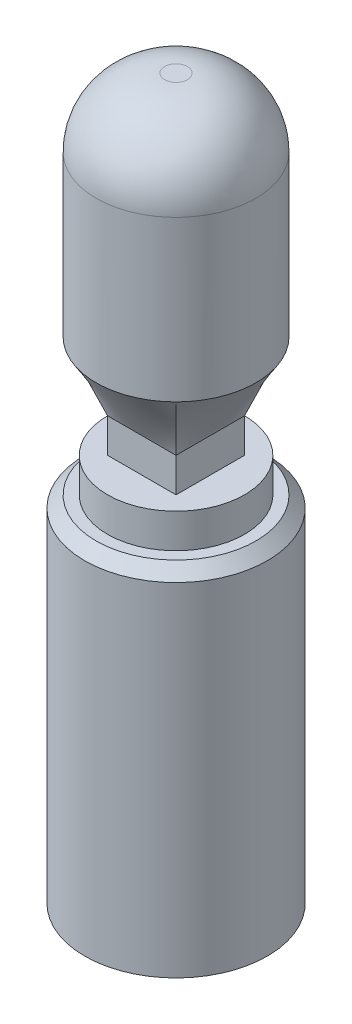
ISO-10303-21;
HEADER;
FILE_DESCRIPTION(('STEP AP214'),'2;1');
FILE_NAME('part.step','',(''),(''),'','','');
FILE_SCHEMA(('AUTOMOTIVE_DESIGN { 1 0 10303 214 1 1 1 1 }'));
ENDSEC;
DATA;
#1=APPLICATION_CONTEXT('core data for automotive mechanical design processes');
#2=APPLICATION_PROTOCOL_DEFINITION('international standard','automotive_design',2000,#1);
#3=PRODUCT_CONTEXT('',#1,'mechanical');
#4=PRODUCT('Part','Part','',(#3));
#5=PRODUCT_RELATED_PRODUCT_CATEGORY('part','',(#4));
#6=PRODUCT_DEFINITION_FORMATION('','',#4);
#7=PRODUCT_DEFINITION_CONTEXT('part definition',#1,'design');
#8=PRODUCT_DEFINITION('design','',#6,#7);
#9=PRODUCT_DEFINITION_SHAPE('','',#8);
#10=(LENGTH_UNIT() NAMED_UNIT(*) SI_UNIT(.MILLI.,.METRE.));
#11=(NAMED_UNIT(*) PLANE_ANGLE_UNIT() SI_UNIT($,.RADIAN.));
#12=(NAMED_UNIT(*) SI_UNIT($,.STERADIAN.) SOLID_ANGLE_UNIT());
#13=UNCERTAINTY_MEASURE_WITH_UNIT(LENGTH_MEASURE(1.E-05),#10,'distance_accuracy_value','');
#14=(GEOMETRIC_REPRESENTATION_CONTEXT(3) GLOBAL_UNCERTAINTY_ASSIGNED_CONTEXT((#13)) GLOBAL_UNIT_ASSIGNED_CONTEXT((#10,
#11,#12)) REPRESENTATION_CONTEXT('',''));
#15=CARTESIAN_POINT('',(0.,0.,0.));
#16=DIRECTION('',(0.,0.,1.));
#17=DIRECTION('',(1.,0.,0.));
#18=AXIS2_PLACEMENT_3D('',#15,#16,#17);
#19=CARTESIAN_POINT('',(0.,30.,0.));
#20=DIRECTION('',(0.,-1.,0.));
#21=DIRECTION('',(0.,0.,-1.));
#22=AXIS2_PLACEMENT_3D('',#19,#20,#21);
#23=CYLINDRICAL_SURFACE('',#22,8.);
#24=CARTESIAN_POINT('',(0.,30.,0.));
#25=DIRECTION('',(0.,1.,0.));
#26=DIRECTION('',(0.,0.,1.));
#27=AXIS2_PLACEMENT_3D('',#24,#25,#26);
#28=CIRCLE('',#27,8.);
#29=CARTESIAN_POINT('',(0.,30.,8.));
#30=VERTEX_POINT('',#29);
#31=EDGE_CURVE('E156',#30,#30,#28,.T.);
#32=ORIENTED_EDGE('',*,*,#31,.F.);
#33=EDGE_LOOP('',(#32));
#34=FACE_BOUND('',#33,.T.);
#35=CARTESIAN_POINT('',(0.,0.,0.));
#36=DIRECTION('',(0.,1.,0.));
#37=DIRECTION('',(0.,0.,1.));
#38=AXIS2_PLACEMENT_3D('',#35,#36,#37);
#39=CIRCLE('',#38,8.);
#40=CARTESIAN_POINT('',(0.,0.,8.));
#41=VERTEX_POINT('',#40);
#42=EDGE_CURVE('E159',#41,#41,#39,.T.);
#43=ORIENTED_EDGE('',*,*,#42,.T.);
#44=EDGE_LOOP('',(#43));
#45=FACE_BOUND('',#44,.T.);
#46=ADVANCED_FACE('F62',(#34,#45),#23,.T.);
#47=CARTESIAN_POINT('',(0.,0.,0.));
#48=DIRECTION('',(0.,1.,0.));
#49=DIRECTION('',(0.,0.,1.));
#50=AXIS2_PLACEMENT_3D('',#47,#48,#49);
#51=PLANE('',#50);
#52=CARTESIAN_POINT('',(0.,0.,0.));
#53=DIRECTION('',(0.,-1.,0.));
#54=DIRECTION('',(0.,0.,-1.));
#55=AXIS2_PLACEMENT_3D('',#52,#53,#54);
#56=CIRCLE('',#55,2.05);
#57=CARTESIAN_POINT('',(0.,0.,-2.05));
#58=VERTEX_POINT('',#57);
#59=EDGE_CURVE('E346',#58,#58,#56,.T.);
#60=ORIENTED_EDGE('',*,*,#59,.F.);
#61=EDGE_LOOP('',(#60));
#62=FACE_BOUND('',#61,.T.);
#63=ORIENTED_EDGE('',*,*,#42,.F.);
#64=EDGE_LOOP('',(#63));
#65=FACE_BOUND('',#64,.T.);
#66=ADVANCED_FACE('F217',(#62,#65),#51,.F.);
#67=CARTESIAN_POINT('',(0.,30.,0.));
#68=DIRECTION('',(0.,-1.,0.));
#69=DIRECTION('',(0.,0.,1.));
#70=AXIS2_PLACEMENT_3D('',#67,#68,#69);
#71=CONICAL_SURFACE('',#70,8.,0.78539816339745);
#72=CARTESIAN_POINT('',(0.,31.,0.));
#73=DIRECTION('',(0.,1.,0.));
#74=DIRECTION('',(0.,0.,1.));
#75=AXIS2_PLACEMENT_3D('',#72,#73,#74);
#76=CIRCLE('',#75,7.);
#77=CARTESIAN_POINT('',(0.,31.,7.));
#78=VERTEX_POINT('',#77);
#79=EDGE_CURVE('E152',#78,#78,#76,.T.);
#80=ORIENTED_EDGE('',*,*,#79,.F.);
#81=EDGE_LOOP('',(#80));
#82=FACE_BOUND('',#81,.T.);
#83=ORIENTED_EDGE('',*,*,#31,.T.);
#84=EDGE_LOOP('',(#83));
#85=FACE_BOUND('',#84,.T.);
#86=ADVANCED_FACE('F222',(#82,#85),#71,.T.);
#87=CARTESIAN_POINT('',(0.,31.,0.));
#88=DIRECTION('',(0.,1.,0.));
#89=DIRECTION('',(0.,0.,1.));
#90=AXIS2_PLACEMENT_3D('',#87,#88,#89);
#91=PLANE('',#90);
#92=CARTESIAN_POINT('',(0.,31.,0.));
#93=DIRECTION('',(0.,1.,0.));
#94=DIRECTION('',(0.,0.,1.));
#95=AXIS2_PLACEMENT_3D('',#92,#93,#94);
#96=CIRCLE('',#95,6.);
#97=CARTESIAN_POINT('',(0.,31.,6.));
#98=VERTEX_POINT('',#97);
#99=EDGE_CURVE('E153',#98,#98,#96,.T.);
#100=ORIENTED_EDGE('',*,*,#99,.F.);
#101=EDGE_LOOP('',(#100));
#102=FACE_BOUND('',#101,.T.);
#103=ORIENTED_EDGE('',*,*,#79,.T.);
#104=EDGE_LOOP('',(#103));
#105=FACE_BOUND('',#104,.T.);
#106=ADVANCED_FACE('F230',(#102,#105),#91,.T.);
#107=CARTESIAN_POINT('',(0.,34.,0.));
#108=DIRECTION('',(0.,-1.,0.));
#109=DIRECTION('',(0.,0.,-1.));
#110=AXIS2_PLACEMENT_3D('',#107,#108,#109);
#111=CYLINDRICAL_SURFACE('',#110,6.);
#112=CARTESIAN_POINT('',(0.,34.,0.));
#113=DIRECTION('',(0.,1.,0.));
#114=DIRECTION('',(0.,0.,1.));
#115=AXIS2_PLACEMENT_3D('',#112,#113,#114);
#116=CIRCLE('',#115,6.);
#117=CARTESIAN_POINT('',(0.,34.,6.));
#118=VERTEX_POINT('',#117);
#119=EDGE_CURVE('E131',#118,#118,#116,.T.);
#120=ORIENTED_EDGE('',*,*,#119,.F.);
#121=EDGE_LOOP('',(#120));
#122=FACE_BOUND('',#121,.T.);
#123=ORIENTED_EDGE('',*,*,#99,.T.);
#124=EDGE_LOOP('',(#123));
#125=FACE_BOUND('',#124,.T.);
#126=ADVANCED_FACE('F234',(#122,#125),#111,.T.);
#127=CARTESIAN_POINT('',(0.,34.,0.));
#128=DIRECTION('',(0.,1.,0.));
#129=DIRECTION('',(0.,0.,1.));
#130=AXIS2_PLACEMENT_3D('',#127,#128,#129);
#131=PLANE('',#130);
#132=DIRECTION('',(0.,0.,-1.));
#133=VECTOR('',#132,1.);
#134=CARTESIAN_POINT('',(3.,34.,3.));
#135=LINE('',#134,#133);
#136=CARTESIAN_POINT('',(3.,34.,3.));
#137=VERTEX_POINT('',#136);
#138=CARTESIAN_POINT('',(3.,34.,-3.));
#139=VERTEX_POINT('',#138);
#140=EDGE_CURVE('E79',#137,#139,#135,.T.);
#141=ORIENTED_EDGE('',*,*,#140,.F.);
#142=DIRECTION('',(1.,0.,0.));
#143=VECTOR('',#142,1.);
#144=CARTESIAN_POINT('',(-3.,34.,3.));
#145=LINE('',#144,#143);
#146=CARTESIAN_POINT('',(-3.,34.,3.));
#147=VERTEX_POINT('',#146);
#148=EDGE_CURVE('E148',#147,#137,#145,.T.);
#149=ORIENTED_EDGE('',*,*,#148,.F.);
#150=DIRECTION('',(0.,0.,1.));
#151=VECTOR('',#150,1.);
#152=CARTESIAN_POINT('',(-3.,34.,3.));
#153=LINE('',#152,#151);
#154=CARTESIAN_POINT('',(-3.,34.,-3.));
#155=VERTEX_POINT('',#154);
#156=EDGE_CURVE('E122',#155,#147,#153,.T.);
#157=ORIENTED_EDGE('',*,*,#156,.F.);
#158=DIRECTION('',(-1.,0.,0.));
#159=VECTOR('',#158,1.);
#160=CARTESIAN_POINT('',(-3.,34.,-3.));
#161=LINE('',#160,#159);
#162=EDGE_CURVE('E117',#139,#155,#161,.T.);
#163=ORIENTED_EDGE('',*,*,#162,.F.);
#164=EDGE_LOOP('',(#141,#149,#157,#163));
#165=FACE_BOUND('',#164,.T.);
#166=ORIENTED_EDGE('',*,*,#119,.T.);
#167=EDGE_LOOP('',(#166));
#168=FACE_BOUND('',#167,.T.);
#169=ADVANCED_FACE('F119',(#165,#168),#131,.T.);
#170=CARTESIAN_POINT('',(3.,37.,3.));
#171=DIRECTION('',(-1.,0.,0.));
#172=DIRECTION('',(0.,0.,1.));
#173=AXIS2_PLACEMENT_3D('',#170,#171,#172);
#174=PLANE('',#173);
#175=ORIENTED_EDGE('',*,*,#140,.T.);
#176=DIRECTION('',(0.,-1.,0.));
#177=VECTOR('',#176,1.);
#178=CARTESIAN_POINT('',(3.,37.,-3.));
#179=LINE('',#178,#177);
#180=CARTESIAN_POINT('',(3.,37.,-3.));
#181=VERTEX_POINT('',#180);
#182=EDGE_CURVE('E127',#181,#139,#179,.T.);
#183=ORIENTED_EDGE('',*,*,#182,.F.);
#184=DIRECTION('',(0.,0.,1.));
#185=VECTOR('',#184,1.);
#186=CARTESIAN_POINT('',(3.,37.,3.));
#187=LINE('',#186,#185);
#188=CARTESIAN_POINT('',(3.,37.,3.));
#189=VERTEX_POINT('',#188);
#190=EDGE_CURVE('E98',#189,#181,#187,.F.);
#191=ORIENTED_EDGE('',*,*,#190,.F.);
#192=DIRECTION('',(0.,-1.,0.));
#193=VECTOR('',#192,1.);
#194=CARTESIAN_POINT('',(3.,37.,3.));
#195=LINE('',#194,#193);
#196=EDGE_CURVE('E135',#189,#137,#195,.T.);
#197=ORIENTED_EDGE('',*,*,#196,.T.);
#198=EDGE_LOOP('',(#175,#183,#191,#197));
#199=FACE_BOUND('',#198,.T.);
#200=ADVANCED_FACE('F134',(#199),#174,.F.);
#201=CARTESIAN_POINT('',(-3.,37.,-3.));
#202=DIRECTION('',(0.,0.,1.));
#203=DIRECTION('',(1.,0.,0.));
#204=AXIS2_PLACEMENT_3D('',#201,#202,#203);
#205=PLANE('',#204);
#206=ORIENTED_EDGE('',*,*,#162,.T.);
#207=DIRECTION('',(0.,-1.,0.));
#208=VECTOR('',#207,1.);
#209=CARTESIAN_POINT('',(-3.,37.,-3.));
#210=LINE('',#209,#208);
#211=CARTESIAN_POINT('',(-3.,37.,-3.));
#212=VERTEX_POINT('',#211);
#213=EDGE_CURVE('E132',#212,#155,#210,.T.);
#214=ORIENTED_EDGE('',*,*,#213,.F.);
#215=DIRECTION('',(1.,0.,0.));
#216=VECTOR('',#215,1.);
#217=CARTESIAN_POINT('',(-3.,37.,-3.));
#218=LINE('',#217,#216);
#219=EDGE_CURVE('E130',#181,#212,#218,.F.);
#220=ORIENTED_EDGE('',*,*,#219,.F.);
#221=ORIENTED_EDGE('',*,*,#182,.T.);
#222=EDGE_LOOP('',(#206,#214,#220,#221));
#223=FACE_BOUND('',#222,.T.);
#224=ADVANCED_FACE('F128',(#223),#205,.F.);
#225=CARTESIAN_POINT('',(-3.,37.,3.));
#226=DIRECTION('',(1.,0.,0.));
#227=DIRECTION('',(0.,0.,-1.));
#228=AXIS2_PLACEMENT_3D('',#225,#226,#227);
#229=PLANE('',#228);
#230=ORIENTED_EDGE('',*,*,#156,.T.);
#231=DIRECTION('',(0.,-1.,0.));
#232=VECTOR('',#231,1.);
#233=CARTESIAN_POINT('',(-3.,37.,3.));
#234=LINE('',#233,#232);
#235=CARTESIAN_POINT('',(-3.,37.,3.));
#236=VERTEX_POINT('',#235);
#237=EDGE_CURVE('E165',#236,#147,#234,.T.);
#238=ORIENTED_EDGE('',*,*,#237,.F.);
#239=DIRECTION('',(0.,0.,-1.));
#240=VECTOR('',#239,1.);
#241=CARTESIAN_POINT('',(-3.,37.,3.));
#242=LINE('',#241,#240);
#243=EDGE_CURVE('E172',#212,#236,#242,.F.);
#244=ORIENTED_EDGE('',*,*,#243,.F.);
#245=ORIENTED_EDGE('',*,*,#213,.T.);
#246=EDGE_LOOP('',(#230,#238,#244,#245));
#247=FACE_BOUND('',#246,.T.);
#248=ADVANCED_FACE('F245',(#247),#229,.F.);
#249=CARTESIAN_POINT('',(-3.,37.,3.));
#250=DIRECTION('',(0.,0.,-1.));
#251=DIRECTION('',(-1.,0.,0.));
#252=AXIS2_PLACEMENT_3D('',#249,#250,#251);
#253=PLANE('',#252);
#254=ORIENTED_EDGE('',*,*,#148,.T.);
#255=ORIENTED_EDGE('',*,*,#196,.F.);
#256=DIRECTION('',(-1.,0.,0.));
#257=VECTOR('',#256,1.);
#258=CARTESIAN_POINT('',(-3.,37.,3.));
#259=LINE('',#258,#257);
#260=EDGE_CURVE('E166',#236,#189,#259,.F.);
#261=ORIENTED_EDGE('',*,*,#260,.F.);
#262=ORIENTED_EDGE('',*,*,#237,.T.);
#263=EDGE_LOOP('',(#254,#255,#261,#262));
#264=FACE_BOUND('',#263,.T.);
#265=ADVANCED_FACE('F248',(#264),#253,.F.);
#266=CARTESIAN_POINT('',(-4.94974746830583,43.,-4.94974746830583));
#267=CARTESIAN_POINT('',(-3.,37.,-3.));
#268=CARTESIAN_POINT('',(-4.65808080163917,43.,-5.2414141349725));
#269=CARTESIAN_POINT('',(-2.75,37.,-3.));
#270=CARTESIAN_POINT('',(-4.32957833687793,43.,-5.51805960745283));
#271=CARTESIAN_POINT('',(-2.5,37.,-3.));
#272=CARTESIAN_POINT('',(-3.60330586290059,43.,-6.01750922433455));
#273=CARTESIAN_POINT('',(-2.,37.,-3.));
#274=CARTESIAN_POINT('',(-3.20549876475148,43.,-6.240151659734));
#275=CARTESIAN_POINT('',(-1.75,37.,-3.));
#276=CARTESIAN_POINT('',(-2.35498410023551,43.,-6.60823463225559));
#277=CARTESIAN_POINT('',(-1.25,37.,-3.));
#278=CARTESIAN_POINT('',(-1.9023431213879,43.,-6.75349475440457));
#279=CARTESIAN_POINT('',(-0.999999999999999,37.,-3.));
#280=CARTESIAN_POINT('',(-0.966389520987096,43.,-6.9494382537719));
#281=CARTESIAN_POINT('',(-0.499999999999999,37.,-3.));
#282=CARTESIAN_POINT('',(-0.483249156101943,43.,-7.));
#283=CARTESIAN_POINT('',(-0.249999999999999,37.,-3.));
#284=CARTESIAN_POINT('',(0.483249156101945,43.,-7.));
#285=CARTESIAN_POINT('',(0.250000000000001,37.,-3.));
#286=CARTESIAN_POINT('',(0.966389520987098,43.,-6.9494382537719));
#287=CARTESIAN_POINT('',(0.500000000000001,37.,-3.));
#288=CARTESIAN_POINT('',(1.9023431213879,43.,-6.75349475440457));
#289=CARTESIAN_POINT('',(1.,37.,-3.));
#290=CARTESIAN_POINT('',(2.35498410023551,43.,-6.60823463225559));
#291=CARTESIAN_POINT('',(1.25,37.,-3.));
#292=CARTESIAN_POINT('',(3.20549876475148,43.,-6.240151659734));
#293=CARTESIAN_POINT('',(1.75,37.,-3.));
#294=CARTESIAN_POINT('',(3.60330586290059,43.,-6.01750922433454));
#295=CARTESIAN_POINT('',(2.,37.,-3.));
#296=CARTESIAN_POINT('',(4.32957833687793,43.,-5.51805960745283));
#297=CARTESIAN_POINT('',(2.5,37.,-3.));
#298=CARTESIAN_POINT('',(4.65808080163917,43.,-5.2414141349725));
#299=CARTESIAN_POINT('',(2.75,37.,-3.));
#300=CARTESIAN_POINT('',(4.94974746830583,43.,-4.94974746830583));
#301=CARTESIAN_POINT('',(3.,37.,-3.));
#302=B_SPLINE_SURFACE_WITH_KNOTS('',3,1,((#266,#267),(#268,#269),(#270,#271),(#272,#273),(#274,
#275),(#276,#277),(#278,#279),(#280,#281),(#282,#283),(#284,#285),(#286,#287),(#288,#289),(#290,
#291),(#292,#293),(#294,#295),(#296,#297),(#298,#299),(#300,#301)),.UNSPECIFIED.,.F.,.F.,.F.,(4,
2,2,2,2,2,2,2,4),(2,2),(0.,0.125,0.25,0.375,0.5,0.625,0.75,0.875,1.),(0.,1.),.UNSPECIFIED.);
#303=CARTESIAN_POINT('',(0.,43.,0.));
#304=DIRECTION('',(0.,1.,0.));
#305=DIRECTION('',(0.,0.,1.));
#306=AXIS2_PLACEMENT_3D('',#303,#304,#305);
#307=CIRCLE('',#306,7.);
#308=CARTESIAN_POINT('',(4.94974746830583,43.,-4.94974746830583));
#309=VERTEX_POINT('',#308);
#310=CARTESIAN_POINT('',(-4.94974746830583,43.,-4.94974746830583));
#311=VERTEX_POINT('',#310);
#312=EDGE_CURVE('E109',#309,#311,#307,.T.);
#313=DIRECTION('',(-0.295270478843705,-0.90864222257543,0.295270478843705));
#314=VECTOR('',#313,1.);
#315=CARTESIAN_POINT('',(3.97487373415292,40.,-3.97487373415292));
#316=LINE('',#315,#314);
#317=EDGE_CURVE('E280',#309,#181,#316,.T.);
#318=DIRECTION('',(-0.295270478843705,0.90864222257543,-0.295270478843705));
#319=VECTOR('',#318,1.);
#320=CARTESIAN_POINT('',(-3.97487373415292,40.,-3.97487373415292));
#321=LINE('',#320,#319);
#322=EDGE_CURVE('E197',#212,#311,#321,.T.);
#323=ORIENTED_EDGE('',*,*,#312,.F.);
#324=ORIENTED_EDGE('',*,*,#317,.T.);
#325=ORIENTED_EDGE('',*,*,#219,.T.);
#326=ORIENTED_EDGE('',*,*,#322,.T.);
#327=EDGE_LOOP('',(#323,#324,#325,#326));
#328=FACE_BOUND('',#327,.T.);
#329=ADVANCED_FACE('F252',(#328),#302,.T.);
#330=CARTESIAN_POINT('',(4.94974746830583,43.,-4.94974746830583));
#331=CARTESIAN_POINT('',(3.,37.,-3.));
#332=CARTESIAN_POINT('',(5.2414141349725,43.,-4.65808080163917));
#333=CARTESIAN_POINT('',(3.,37.,-2.75));
#334=CARTESIAN_POINT('',(5.51805960745283,43.,-4.32957833687792));
#335=CARTESIAN_POINT('',(3.,37.,-2.5));
#336=CARTESIAN_POINT('',(6.01750922433454,43.,-3.60330586290059));
#337=CARTESIAN_POINT('',(3.,37.,-2.));
#338=CARTESIAN_POINT('',(6.240151659734,43.,-3.20549876475148));
#339=CARTESIAN_POINT('',(3.,37.,-1.75));
#340=CARTESIAN_POINT('',(6.6082346322556,43.,-2.35498410023551));
#341=CARTESIAN_POINT('',(3.,37.,-1.25));
#342=CARTESIAN_POINT('',(6.75349475440457,43.,-1.9023431213879));
#343=CARTESIAN_POINT('',(3.,37.,-1.));
#344=CARTESIAN_POINT('',(6.9494382537719,43.,-0.966389520987097));
#345=CARTESIAN_POINT('',(3.,37.,-0.5));
#346=CARTESIAN_POINT('',(7.,43.,-0.483249156101944));
#347=CARTESIAN_POINT('',(3.,37.,-0.25));
#348=CARTESIAN_POINT('',(7.,43.,0.483249156101944));
#349=CARTESIAN_POINT('',(3.,37.,0.250000000000001));
#350=CARTESIAN_POINT('',(6.9494382537719,43.,0.966389520987098));
#351=CARTESIAN_POINT('',(3.,37.,0.5));
#352=CARTESIAN_POINT('',(6.75349475440457,43.,1.9023431213879));
#353=CARTESIAN_POINT('',(3.,37.,1.));
#354=CARTESIAN_POINT('',(6.60823463225559,43.,2.35498410023551));
#355=CARTESIAN_POINT('',(3.,37.,1.25));
#356=CARTESIAN_POINT('',(6.240151659734,43.,3.20549876475148));
#357=CARTESIAN_POINT('',(3.,37.,1.75));
#358=CARTESIAN_POINT('',(6.01750922433455,43.,3.60330586290059));
#359=CARTESIAN_POINT('',(3.,37.,2.));
#360=CARTESIAN_POINT('',(5.51805960745283,43.,4.32957833687793));
#361=CARTESIAN_POINT('',(3.,37.,2.5));
#362=CARTESIAN_POINT('',(5.2414141349725,43.,4.65808080163917));
#363=CARTESIAN_POINT('',(3.,37.,2.75));
#364=CARTESIAN_POINT('',(4.94974746830583,43.,4.94974746830583));
#365=CARTESIAN_POINT('',(3.,37.,3.));
#366=B_SPLINE_SURFACE_WITH_KNOTS('',3,1,((#330,#331),(#332,#333),(#334,#335),(#336,#337),(#338,
#339),(#340,#341),(#342,#343),(#344,#345),(#346,#347),(#348,#349),(#350,#351),(#352,#353),(#354,
#355),(#356,#357),(#358,#359),(#360,#361),(#362,#363),(#364,#365)),.UNSPECIFIED.,.F.,.F.,.F.,(4,
2,2,2,2,2,2,2,4),(2,2),(0.,0.125,0.25,0.375,0.5,0.625,0.75,0.875,1.),(0.,1.),.UNSPECIFIED.);
#367=CARTESIAN_POINT('',(4.94974746830583,43.,4.94974746830583));
#368=VERTEX_POINT('',#367);
#369=EDGE_CURVE('E195',#368,#309,#307,.T.);
#370=DIRECTION('',(-0.295270478843705,-0.90864222257543,-0.295270478843705));
#371=VECTOR('',#370,1.);
#372=CARTESIAN_POINT('',(3.97487373415292,40.,3.97487373415292));
#373=LINE('',#372,#371);
#374=EDGE_CURVE('E139',#368,#189,#373,.T.);
#375=ORIENTED_EDGE('',*,*,#369,.F.);
#376=ORIENTED_EDGE('',*,*,#374,.T.);
#377=ORIENTED_EDGE('',*,*,#190,.T.);
#378=ORIENTED_EDGE('',*,*,#317,.F.);
#379=EDGE_LOOP('',(#375,#376,#377,#378));
#380=FACE_BOUND('',#379,.T.);
#381=ADVANCED_FACE('F300',(#380),#366,.T.);
#382=CARTESIAN_POINT('',(-4.94974746830583,43.,4.94974746830583));
#383=CARTESIAN_POINT('',(-3.,37.,3.));
#384=CARTESIAN_POINT('',(-5.2414141349725,43.,4.65808080163917));
#385=CARTESIAN_POINT('',(-3.,37.,2.75));
#386=CARTESIAN_POINT('',(-5.51805960745283,43.,4.32957833687792));
#387=CARTESIAN_POINT('',(-3.,37.,2.5));
#388=CARTESIAN_POINT('',(-6.01750922433454,43.,3.60330586290059));
#389=CARTESIAN_POINT('',(-3.,37.,2.));
#390=CARTESIAN_POINT('',(-6.240151659734,43.,3.20549876475148));
#391=CARTESIAN_POINT('',(-3.,37.,1.75));
#392=CARTESIAN_POINT('',(-6.60823463225559,43.,2.35498410023551));
#393=CARTESIAN_POINT('',(-3.,37.,1.25));
#394=CARTESIAN_POINT('',(-6.75349475440457,43.,1.9023431213879));
#395=CARTESIAN_POINT('',(-3.,37.,1.));
#396=CARTESIAN_POINT('',(-6.9494382537719,43.,0.966389520987095));
#397=CARTESIAN_POINT('',(-3.,37.,0.5));
#398=CARTESIAN_POINT('',(-7.,43.,0.483249156101943));
#399=CARTESIAN_POINT('',(-3.,37.,0.25));
#400=CARTESIAN_POINT('',(-7.,43.,-0.483249156101946));
#401=CARTESIAN_POINT('',(-3.,37.,-0.25));
#402=CARTESIAN_POINT('',(-6.9494382537719,43.,-0.966389520987099));
#403=CARTESIAN_POINT('',(-3.,37.,-0.5));
#404=CARTESIAN_POINT('',(-6.75349475440457,43.,-1.9023431213879));
#405=CARTESIAN_POINT('',(-3.,37.,-1.));
#406=CARTESIAN_POINT('',(-6.60823463225559,43.,-2.35498410023551));
#407=CARTESIAN_POINT('',(-3.,37.,-1.25));
#408=CARTESIAN_POINT('',(-6.240151659734,43.,-3.20549876475148));
#409=CARTESIAN_POINT('',(-3.,37.,-1.75));
#410=CARTESIAN_POINT('',(-6.01750922433455,43.,-3.6033058629006));
#411=CARTESIAN_POINT('',(-3.,37.,-2.));
#412=CARTESIAN_POINT('',(-5.51805960745283,43.,-4.32957833687792));
#413=CARTESIAN_POINT('',(-3.,37.,-2.5));
#414=CARTESIAN_POINT('',(-5.2414141349725,43.,-4.65808080163917));
#415=CARTESIAN_POINT('',(-3.,37.,-2.75));
#416=CARTESIAN_POINT('',(-4.94974746830583,43.,-4.94974746830583));
#417=CARTESIAN_POINT('',(-3.,37.,-3.));
#418=B_SPLINE_SURFACE_WITH_KNOTS('',3,1,((#382,#383),(#384,#385),(#386,#387),(#388,#389),(#390,
#391),(#392,#393),(#394,#395),(#396,#397),(#398,#399),(#400,#401),(#402,#403),(#404,#405),(#406,
#407),(#408,#409),(#410,#411),(#412,#413),(#414,#415),(#416,#417)),.UNSPECIFIED.,.F.,.F.,.F.,(4,
2,2,2,2,2,2,2,4),(2,2),(0.,0.125,0.25,0.375,0.5,0.625,0.75,0.875,1.),(0.,1.),.UNSPECIFIED.);
#419=CARTESIAN_POINT('',(-4.94974746830583,43.,4.94974746830583));
#420=VERTEX_POINT('',#419);
#421=EDGE_CURVE('E181',#311,#420,#307,.T.);
#422=DIRECTION('',(0.295270478843705,-0.90864222257543,-0.295270478843705));
#423=VECTOR('',#422,1.);
#424=CARTESIAN_POINT('',(-3.97487373415292,40.,3.97487373415292));
#425=LINE('',#424,#423);
#426=EDGE_CURVE('E136',#420,#236,#425,.T.);
#427=ORIENTED_EDGE('',*,*,#421,.F.);
#428=ORIENTED_EDGE('',*,*,#322,.F.);
#429=ORIENTED_EDGE('',*,*,#243,.T.);
#430=ORIENTED_EDGE('',*,*,#426,.F.);
#431=EDGE_LOOP('',(#427,#428,#429,#430));
#432=FACE_BOUND('',#431,.T.);
#433=ADVANCED_FACE('F259',(#432),#418,.T.);
#434=CARTESIAN_POINT('',(4.94974746830583,43.,4.94974746830583));
#435=CARTESIAN_POINT('',(3.,37.,3.));
#436=CARTESIAN_POINT('',(4.65808080163917,43.,5.2414141349725));
#437=CARTESIAN_POINT('',(2.75,37.,3.));
#438=CARTESIAN_POINT('',(4.32957833687793,43.,5.51805960745283));
#439=CARTESIAN_POINT('',(2.5,37.,3.));
#440=CARTESIAN_POINT('',(3.60330586290059,43.,6.01750922433454));
#441=CARTESIAN_POINT('',(2.,37.,3.));
#442=CARTESIAN_POINT('',(3.20549876475148,43.,6.240151659734));
#443=CARTESIAN_POINT('',(1.75,37.,3.));
#444=CARTESIAN_POINT('',(2.35498410023551,43.,6.60823463225559));
#445=CARTESIAN_POINT('',(1.25,37.,3.));
#446=CARTESIAN_POINT('',(1.9023431213879,43.,6.75349475440457));
#447=CARTESIAN_POINT('',(1.,37.,3.));
#448=CARTESIAN_POINT('',(0.966389520987096,43.,6.9494382537719));
#449=CARTESIAN_POINT('',(0.5,37.,3.));
#450=CARTESIAN_POINT('',(0.483249156101944,43.,7.));
#451=CARTESIAN_POINT('',(0.25,37.,3.));
#452=CARTESIAN_POINT('',(-0.483249156101945,43.,7.));
#453=CARTESIAN_POINT('',(-0.25,37.,3.));
#454=CARTESIAN_POINT('',(-0.966389520987098,43.,6.9494382537719));
#455=CARTESIAN_POINT('',(-0.5,37.,3.));
#456=CARTESIAN_POINT('',(-1.9023431213879,43.,6.75349475440457));
#457=CARTESIAN_POINT('',(-1.,37.,3.));
#458=CARTESIAN_POINT('',(-2.35498410023551,43.,6.60823463225559));
#459=CARTESIAN_POINT('',(-1.25,37.,3.));
#460=CARTESIAN_POINT('',(-3.20549876475148,43.,6.240151659734));
#461=CARTESIAN_POINT('',(-1.75,37.,3.));
#462=CARTESIAN_POINT('',(-3.6033058629006,43.,6.01750922433455));
#463=CARTESIAN_POINT('',(-2.,37.,3.));
#464=CARTESIAN_POINT('',(-4.32957833687792,43.,5.51805960745283));
#465=CARTESIAN_POINT('',(-2.5,37.,3.));
#466=CARTESIAN_POINT('',(-4.65808080163917,43.,5.2414141349725));
#467=CARTESIAN_POINT('',(-2.75,37.,3.));
#468=CARTESIAN_POINT('',(-4.94974746830583,43.,4.94974746830583));
#469=CARTESIAN_POINT('',(-3.,37.,3.));
#470=B_SPLINE_SURFACE_WITH_KNOTS('',3,1,((#434,#435),(#436,#437),(#438,#439),(#440,#441),(#442,
#443),(#444,#445),(#446,#447),(#448,#449),(#450,#451),(#452,#453),(#454,#455),(#456,#457),(#458,
#459),(#460,#461),(#462,#463),(#464,#465),(#466,#467),(#468,#469)),.UNSPECIFIED.,.F.,.F.,.F.,(4,
2,2,2,2,2,2,2,4),(2,2),(0.,0.125,0.25,0.375,0.5,0.625,0.75,0.875,1.),(0.,1.),.UNSPECIFIED.);
#471=EDGE_CURVE('E177',#420,#368,#307,.T.);
#472=ORIENTED_EDGE('',*,*,#471,.F.);
#473=ORIENTED_EDGE('',*,*,#426,.T.);
#474=ORIENTED_EDGE('',*,*,#260,.T.);
#475=ORIENTED_EDGE('',*,*,#374,.F.);
#476=EDGE_LOOP('',(#472,#473,#474,#475));
#477=FACE_BOUND('',#476,.T.);
#478=ADVANCED_FACE('F254',(#477),#470,.T.);
#479=CARTESIAN_POINT('',(0.,63.,0.));
#480=DIRECTION('',(0.,-1.,0.));
#481=DIRECTION('',(0.,0.,-1.));
#482=AXIS2_PLACEMENT_3D('',#479,#480,#481);
#483=CYLINDRICAL_SURFACE('',#482,7.);
#484=CARTESIAN_POINT('',(0.,57.,0.));
#485=DIRECTION('',(0.,1.,0.));
#486=DIRECTION('',(0.,0.,1.));
#487=AXIS2_PLACEMENT_3D('',#484,#485,#486);
#488=CIRCLE('',#487,7.);
#489=CARTESIAN_POINT('',(0.,57.,7.));
#490=VERTEX_POINT('',#489);
#491=EDGE_CURVE('E12',#490,#490,#488,.F.);
#492=ORIENTED_EDGE('',*,*,#491,.T.);
#493=EDGE_LOOP('',(#492));
#494=FACE_BOUND('',#493,.T.);
#495=ORIENTED_EDGE('',*,*,#369,.T.);
#496=ORIENTED_EDGE('',*,*,#312,.T.);
#497=ORIENTED_EDGE('',*,*,#421,.T.);
#498=ORIENTED_EDGE('',*,*,#471,.T.);
#499=EDGE_LOOP('',(#495,#496,#497,#498));
#500=FACE_BOUND('',#499,.T.);
#501=ADVANCED_FACE('F213',(#494,#500),#483,.T.);
#502=CARTESIAN_POINT('',(0.,63.,0.));
#503=DIRECTION('',(0.,1.,0.));
#504=DIRECTION('',(0.,0.,1.));
#505=AXIS2_PLACEMENT_3D('',#502,#503,#504);
#506=PLANE('',#505);
#507=CARTESIAN_POINT('',(0.,63.,0.));
#508=DIRECTION('',(0.,1.,0.));
#509=DIRECTION('',(0.,0.,1.));
#510=AXIS2_PLACEMENT_3D('',#507,#508,#509);
#511=CIRCLE('',#510,1.);
#512=CARTESIAN_POINT('',(0.,63.,1.));
#513=VERTEX_POINT('',#512);
#514=EDGE_CURVE('E71',#513,#513,#511,.T.);
#515=ORIENTED_EDGE('',*,*,#514,.T.);
#516=EDGE_LOOP('',(#515));
#517=FACE_BOUND('',#516,.T.);
#518=ADVANCED_FACE('F201',(#517),#506,.T.);
#519=CARTESIAN_POINT('',(0.,57.,0.));
#520=DIRECTION('',(0.,1.,0.));
#521=DIRECTION('',(0.,0.,1.));
#522=AXIS2_PLACEMENT_3D('',#519,#520,#521);
#523=DEGENERATE_TOROIDAL_SURFACE('',#522,1.,6.,.T.);
#524=ORIENTED_EDGE('',*,*,#491,.F.);
#525=EDGE_LOOP('',(#524));
#526=FACE_BOUND('',#525,.T.);
#527=ORIENTED_EDGE('',*,*,#514,.F.);
#528=EDGE_LOOP('',(#527));
#529=FACE_BOUND('',#528,.T.);
#530=ADVANCED_FACE('F64',(#526,#529),#523,.T.);
#531=CARTESIAN_POINT('',(0.,6.,0.));
#532=DIRECTION('',(0.,-1.,0.));
#533=DIRECTION('',(0.,0.,-1.));
#534=AXIS2_PLACEMENT_3D('',#531,#532,#533);
#535=CYLINDRICAL_SURFACE('',#534,2.05);
#536=CARTESIAN_POINT('',(0.,6.,0.));
#537=DIRECTION('',(0.,-1.,0.));
#538=DIRECTION('',(0.,0.,-1.));
#539=AXIS2_PLACEMENT_3D('',#536,#537,#538);
#540=CIRCLE('',#539,2.05);
#541=CARTESIAN_POINT('',(0.,6.,-2.05));
#542=VERTEX_POINT('',#541);
#543=EDGE_CURVE('E182',#542,#542,#540,.T.);
#544=ORIENTED_EDGE('',*,*,#543,.F.);
#545=EDGE_LOOP('',(#544));
#546=FACE_BOUND('',#545,.T.);
#547=ORIENTED_EDGE('',*,*,#59,.T.);
#548=EDGE_LOOP('',(#547));
#549=FACE_BOUND('',#548,.T.);
#550=ADVANCED_FACE('F204',(#546,#549),#535,.F.);
#551=CARTESIAN_POINT('',(0.,6.,0.));
#552=DIRECTION('',(0.,-1.,0.));
#553=DIRECTION('',(0.,0.,-1.));
#554=AXIS2_PLACEMENT_3D('',#551,#552,#553);
#555=PLANE('',#554);
#556=ORIENTED_EDGE('',*,*,#543,.T.);
#557=EDGE_LOOP('',(#556));
#558=FACE_BOUND('',#557,.T.);
#559=ADVANCED_FACE('F210',(#558),#555,.T.);
#560=CLOSED_SHELL('',(#46,#66,#86,#106,#126,#169,#200,#224,#248,#265,#329,#381,#433,#478,#501,
#518,#530,#550,#559));
#561=MANIFOLD_SOLID_BREP('B2',#560);
#562=ADVANCED_BREP_SHAPE_REPRESENTATION('',(#18,#561),#14);
#563=SHAPE_DEFINITION_REPRESENTATION(#9,#562);
ENDSEC;
END-ISO-10303-21;
